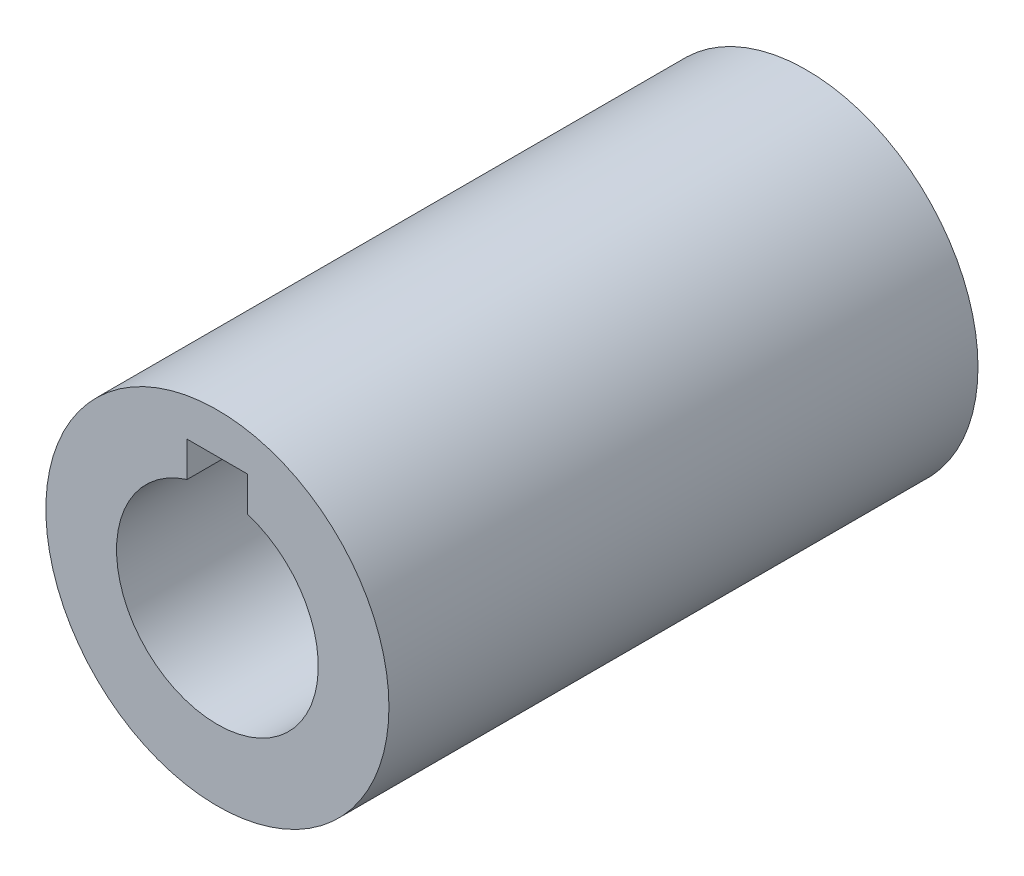
ISO-10303-21;
HEADER;
FILE_DESCRIPTION(('STEP AP214'),'2;1');
FILE_NAME('part.step','',(''),(''),'','','');
FILE_SCHEMA(('AUTOMOTIVE_DESIGN { 1 0 10303 214 1 1 1 1 }'));
ENDSEC;
DATA;
#1=APPLICATION_CONTEXT('core data for automotive mechanical design processes');
#2=APPLICATION_PROTOCOL_DEFINITION('international standard','automotive_design',2000,#1);
#3=PRODUCT_CONTEXT('',#1,'mechanical');
#4=PRODUCT('Part','Part','',(#3));
#5=PRODUCT_RELATED_PRODUCT_CATEGORY('part','',(#4));
#6=PRODUCT_DEFINITION_FORMATION('','',#4);
#7=PRODUCT_DEFINITION_CONTEXT('part definition',#1,'design');
#8=PRODUCT_DEFINITION('design','',#6,#7);
#9=PRODUCT_DEFINITION_SHAPE('','',#8);
#10=(LENGTH_UNIT() NAMED_UNIT(*) SI_UNIT(.MILLI.,.METRE.));
#11=(NAMED_UNIT(*) PLANE_ANGLE_UNIT() SI_UNIT($,.RADIAN.));
#12=(NAMED_UNIT(*) SI_UNIT($,.STERADIAN.) SOLID_ANGLE_UNIT());
#13=UNCERTAINTY_MEASURE_WITH_UNIT(LENGTH_MEASURE(1.E-05),#10,'distance_accuracy_value','');
#14=(GEOMETRIC_REPRESENTATION_CONTEXT(3) GLOBAL_UNCERTAINTY_ASSIGNED_CONTEXT((#13)) GLOBAL_UNIT_ASSIGNED_CONTEXT((#10,
#11,#12)) REPRESENTATION_CONTEXT('',''));
#15=CARTESIAN_POINT('',(0.,0.,0.));
#16=DIRECTION('',(0.,0.,1.));
#17=DIRECTION('',(1.,0.,0.));
#18=AXIS2_PLACEMENT_3D('',#15,#16,#17);
#19=CARTESIAN_POINT('',(0.,0.,46.355));
#20=DIRECTION('',(0.,0.,1.));
#21=DIRECTION('',(1.,0.,0.));
#22=AXIS2_PLACEMENT_3D('',#19,#20,#21);
#23=CYLINDRICAL_SURFACE('',#22,13.5);
#24=CARTESIAN_POINT('',(0.,0.,0.));
#25=DIRECTION('',(0.,0.,1.));
#26=DIRECTION('',(1.,0.,0.));
#27=AXIS2_PLACEMENT_3D('',#24,#25,#26);
#28=CIRCLE('',#27,13.5);
#29=CARTESIAN_POINT('',(13.5,0.,0.));
#30=VERTEX_POINT('',#29);
#31=EDGE_CURVE('E94',#30,#30,#28,.F.);
#32=ORIENTED_EDGE('',*,*,#31,.F.);
#33=EDGE_LOOP('',(#32));
#34=FACE_BOUND('',#33,.T.);
#35=CARTESIAN_POINT('',(0.,0.,46.355));
#36=DIRECTION('',(0.,0.,1.));
#37=DIRECTION('',(1.,0.,0.));
#38=AXIS2_PLACEMENT_3D('',#35,#36,#37);
#39=CIRCLE('',#38,13.5);
#40=CARTESIAN_POINT('',(13.5,0.,46.355));
#41=VERTEX_POINT('',#40);
#42=EDGE_CURVE('E21',#41,#41,#39,.T.);
#43=ORIENTED_EDGE('',*,*,#42,.F.);
#44=EDGE_LOOP('',(#43));
#45=FACE_BOUND('',#44,.T.);
#46=ADVANCED_FACE('F17',(#34,#45),#23,.T.);
#47=CARTESIAN_POINT('',(2.38125,7.43454953180935,-2.31775));
#48=DIRECTION('',(-1.,0.,0.));
#49=DIRECTION('',(0.,0.,1.));
#50=AXIS2_PLACEMENT_3D('',#47,#48,#49);
#51=PLANE('',#50);
#52=DIRECTION('',(0.,1.,0.));
#53=VECTOR('',#52,1.);
#54=CARTESIAN_POINT('',(2.38125,-14.85,0.));
#55=LINE('',#54,#53);
#56=CARTESIAN_POINT('',(2.38125,7.571892411247,0.));
#57=VERTEX_POINT('',#56);
#58=CARTESIAN_POINT('',(2.38125,10.31875,0.));
#59=VERTEX_POINT('',#58);
#60=EDGE_CURVE('E88',#57,#59,#55,.T.);
#61=ORIENTED_EDGE('',*,*,#60,.F.);
#62=DIRECTION('',(0.,0.,-1.));
#63=VECTOR('',#62,1.);
#64=CARTESIAN_POINT('',(2.38124999999999,7.571892411247,23.1775));
#65=LINE('',#64,#63);
#66=CARTESIAN_POINT('',(2.38125,7.571892411247,46.355));
#67=VERTEX_POINT('',#66);
#68=EDGE_CURVE('E67',#67,#57,#65,.T.);
#69=ORIENTED_EDGE('',*,*,#68,.F.);
#70=DIRECTION('',(0.,1.,0.));
#71=VECTOR('',#70,1.);
#72=CARTESIAN_POINT('',(2.38125,-14.85,46.355));
#73=LINE('',#72,#71);
#74=CARTESIAN_POINT('',(2.38125,10.31875,46.355));
#75=VERTEX_POINT('',#74);
#76=EDGE_CURVE('E64',#75,#67,#73,.F.);
#77=ORIENTED_EDGE('',*,*,#76,.F.);
#78=DIRECTION('',(0.,0.,-1.));
#79=VECTOR('',#78,1.);
#80=CARTESIAN_POINT('',(2.38125,10.31875,48.67275));
#81=LINE('',#80,#79);
#82=EDGE_CURVE('E76',#59,#75,#81,.F.);
#83=ORIENTED_EDGE('',*,*,#82,.F.);
#84=EDGE_LOOP('',(#61,#69,#77,#83));
#85=FACE_BOUND('',#84,.T.);
#86=ADVANCED_FACE('F103',(#85),#51,.T.);
#87=CARTESIAN_POINT('',(-14.85,-14.85,46.355));
#88=DIRECTION('',(0.,0.,1.));
#89=DIRECTION('',(1.,0.,0.));
#90=AXIS2_PLACEMENT_3D('',#87,#88,#89);
#91=PLANE('',#90);
#92=ORIENTED_EDGE('',*,*,#76,.T.);
#93=CARTESIAN_POINT('',(0.,0.,46.355));
#94=DIRECTION('',(0.,0.,1.));
#95=DIRECTION('',(1.,0.,0.));
#96=AXIS2_PLACEMENT_3D('',#93,#94,#95);
#97=CIRCLE('',#96,7.93749999999999);
#98=CARTESIAN_POINT('',(-2.38125,7.57189241124701,46.355));
#99=VERTEX_POINT('',#98);
#100=EDGE_CURVE('E56',#99,#67,#97,.T.);
#101=ORIENTED_EDGE('',*,*,#100,.F.);
#102=DIRECTION('',(0.,1.,0.));
#103=VECTOR('',#102,1.);
#104=CARTESIAN_POINT('',(-2.38125,7.43454953180935,46.355));
#105=LINE('',#104,#103);
#106=CARTESIAN_POINT('',(-2.38125,10.31875,46.355));
#107=VERTEX_POINT('',#106);
#108=EDGE_CURVE('E62',#107,#99,#105,.F.);
#109=ORIENTED_EDGE('',*,*,#108,.F.);
#110=DIRECTION('',(1.,0.,0.));
#111=VECTOR('',#110,1.);
#112=CARTESIAN_POINT('',(-2.619375,10.31875,46.355));
#113=LINE('',#112,#111);
#114=EDGE_CURVE('E86',#75,#107,#113,.F.);
#115=ORIENTED_EDGE('',*,*,#114,.F.);
#116=EDGE_LOOP('',(#92,#101,#109,#115));
#117=FACE_BOUND('',#116,.T.);
#118=ORIENTED_EDGE('',*,*,#42,.T.);
#119=EDGE_LOOP('',(#118));
#120=FACE_BOUND('',#119,.T.);
#121=ADVANCED_FACE('F58',(#117,#120),#91,.T.);
#122=CARTESIAN_POINT('',(0.,0.,0.));
#123=DIRECTION('',(0.,0.,1.));
#124=DIRECTION('',(1.,0.,0.));
#125=AXIS2_PLACEMENT_3D('',#122,#123,#124);
#126=CYLINDRICAL_SURFACE('',#125,7.93749999999999);
#127=CARTESIAN_POINT('',(0.,0.,0.));
#128=DIRECTION('',(0.,0.,1.));
#129=DIRECTION('',(1.,0.,0.));
#130=AXIS2_PLACEMENT_3D('',#127,#128,#129);
#131=CIRCLE('',#130,7.93749999999999);
#132=CARTESIAN_POINT('',(-2.38125,7.57189241124701,0.));
#133=VERTEX_POINT('',#132);
#134=EDGE_CURVE('E72',#133,#57,#131,.T.);
#135=ORIENTED_EDGE('',*,*,#134,.F.);
#136=DIRECTION('',(0.,0.,-1.));
#137=VECTOR('',#136,1.);
#138=CARTESIAN_POINT('',(-2.38125,7.57189241124702,48.67275));
#139=LINE('',#138,#137);
#140=EDGE_CURVE('E69',#99,#133,#139,.T.);
#141=ORIENTED_EDGE('',*,*,#140,.F.);
#142=ORIENTED_EDGE('',*,*,#100,.T.);
#143=ORIENTED_EDGE('',*,*,#68,.T.);
#144=EDGE_LOOP('',(#135,#141,#142,#143));
#145=FACE_BOUND('',#144,.T.);
#146=ADVANCED_FACE('F70',(#145),#126,.F.);
#147=CARTESIAN_POINT('',(14.85,-14.85,0.));
#148=DIRECTION('',(0.,0.,-1.));
#149=DIRECTION('',(-1.,0.,0.));
#150=AXIS2_PLACEMENT_3D('',#147,#148,#149);
#151=PLANE('',#150);
#152=ORIENTED_EDGE('',*,*,#60,.T.);
#153=DIRECTION('',(1.,0.,0.));
#154=VECTOR('',#153,1.);
#155=CARTESIAN_POINT('',(-2.619375,10.31875,0.));
#156=LINE('',#155,#154);
#157=CARTESIAN_POINT('',(-2.38125,10.31875,0.));
#158=VERTEX_POINT('',#157);
#159=EDGE_CURVE('E36',#158,#59,#156,.T.);
#160=ORIENTED_EDGE('',*,*,#159,.F.);
#161=DIRECTION('',(0.,1.,0.));
#162=VECTOR('',#161,1.);
#163=CARTESIAN_POINT('',(-2.38125,7.43454953180935,0.));
#164=LINE('',#163,#162);
#165=EDGE_CURVE('E27',#133,#158,#164,.T.);
#166=ORIENTED_EDGE('',*,*,#165,.F.);
#167=ORIENTED_EDGE('',*,*,#134,.T.);
#168=EDGE_LOOP('',(#152,#160,#166,#167));
#169=FACE_BOUND('',#168,.T.);
#170=ORIENTED_EDGE('',*,*,#31,.T.);
#171=EDGE_LOOP('',(#170));
#172=FACE_BOUND('',#171,.T.);
#173=ADVANCED_FACE('F99',(#169,#172),#151,.T.);
#174=CARTESIAN_POINT('',(-2.619375,10.31875,48.67275));
#175=DIRECTION('',(0.,-1.,0.));
#176=DIRECTION('',(0.,0.,-1.));
#177=AXIS2_PLACEMENT_3D('',#174,#175,#176);
#178=PLANE('',#177);
#179=ORIENTED_EDGE('',*,*,#159,.T.);
#180=ORIENTED_EDGE('',*,*,#82,.T.);
#181=ORIENTED_EDGE('',*,*,#114,.T.);
#182=DIRECTION('',(0.,0.,-1.));
#183=VECTOR('',#182,1.);
#184=CARTESIAN_POINT('',(-2.38125,10.31875,48.67275));
#185=LINE('',#184,#183);
#186=EDGE_CURVE('E11',#158,#107,#185,.F.);
#187=ORIENTED_EDGE('',*,*,#186,.F.);
#188=EDGE_LOOP('',(#179,#180,#181,#187));
#189=FACE_BOUND('',#188,.T.);
#190=ADVANCED_FACE('F119',(#189),#178,.T.);
#191=CARTESIAN_POINT('',(-2.38125,7.43454953180935,48.67275));
#192=DIRECTION('',(1.,0.,0.));
#193=DIRECTION('',(0.,0.,-1.));
#194=AXIS2_PLACEMENT_3D('',#191,#192,#193);
#195=PLANE('',#194);
#196=ORIENTED_EDGE('',*,*,#165,.T.);
#197=ORIENTED_EDGE('',*,*,#186,.T.);
#198=ORIENTED_EDGE('',*,*,#108,.T.);
#199=ORIENTED_EDGE('',*,*,#140,.T.);
#200=EDGE_LOOP('',(#196,#197,#198,#199));
#201=FACE_BOUND('',#200,.T.);
#202=ADVANCED_FACE('F19',(#201),#195,.T.);
#203=CLOSED_SHELL('',(#46,#86,#121,#146,#173,#190,#202));
#204=MANIFOLD_SOLID_BREP('B1',#203);
#205=ADVANCED_BREP_SHAPE_REPRESENTATION('',(#18,#204),#14);
#206=SHAPE_DEFINITION_REPRESENTATION(#9,#205);
ENDSEC;
END-ISO-10303-21;
